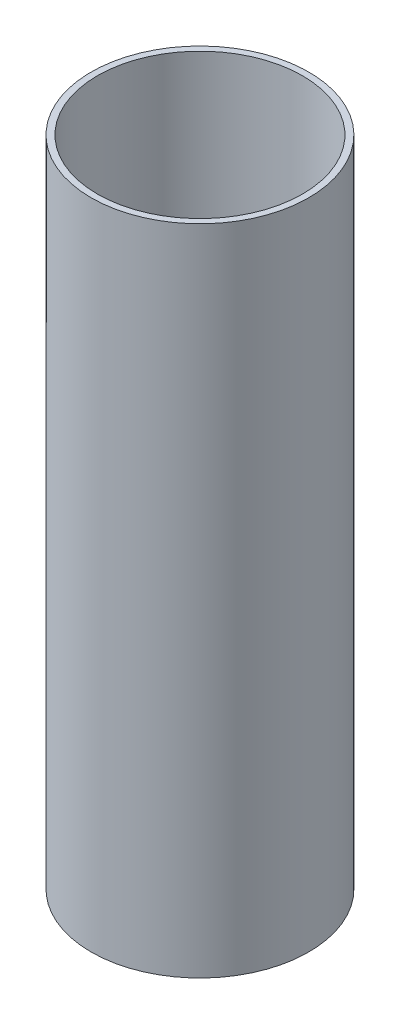
ISO-10303-21;
HEADER;
FILE_DESCRIPTION(('STEP AP214'),'2;1');
FILE_NAME('part.step','',(''),(''),'','','');
FILE_SCHEMA(('AUTOMOTIVE_DESIGN { 1 0 10303 214 1 1 1 1 }'));
ENDSEC;
DATA;
#1=APPLICATION_CONTEXT('core data for automotive mechanical design processes');
#2=APPLICATION_PROTOCOL_DEFINITION('international standard','automotive_design',2000,#1);
#3=PRODUCT_CONTEXT('',#1,'mechanical');
#4=PRODUCT('Part','Part','',(#3));
#5=PRODUCT_RELATED_PRODUCT_CATEGORY('part','',(#4));
#6=PRODUCT_DEFINITION_FORMATION('','',#4);
#7=PRODUCT_DEFINITION_CONTEXT('part definition',#1,'design');
#8=PRODUCT_DEFINITION('design','',#6,#7);
#9=PRODUCT_DEFINITION_SHAPE('','',#8);
#10=(LENGTH_UNIT() NAMED_UNIT(*) SI_UNIT(.MILLI.,.METRE.));
#11=(NAMED_UNIT(*) PLANE_ANGLE_UNIT() SI_UNIT($,.RADIAN.));
#12=(NAMED_UNIT(*) SI_UNIT($,.STERADIAN.) SOLID_ANGLE_UNIT());
#13=UNCERTAINTY_MEASURE_WITH_UNIT(LENGTH_MEASURE(1.E-05),#10,'distance_accuracy_value','');
#14=(GEOMETRIC_REPRESENTATION_CONTEXT(3) GLOBAL_UNCERTAINTY_ASSIGNED_CONTEXT((#13)) GLOBAL_UNIT_ASSIGNED_CONTEXT((#10,
#11,#12)) REPRESENTATION_CONTEXT('',''));
#15=CARTESIAN_POINT('',(0.,0.,0.));
#16=DIRECTION('',(0.,0.,1.));
#17=DIRECTION('',(1.,0.,0.));
#18=AXIS2_PLACEMENT_3D('',#15,#16,#17);
#19=CARTESIAN_POINT('',(0.,0.,0.));
#20=DIRECTION('',(0.,-1.,0.));
#21=DIRECTION('',(0.,0.,-1.));
#22=AXIS2_PLACEMENT_3D('',#19,#20,#21);
#23=CYLINDRICAL_SURFACE('',#22,6.35);
#24=CARTESIAN_POINT('',(0.,-38.1,0.));
#25=DIRECTION('',(0.,1.,0.));
#26=DIRECTION('',(0.,0.,1.));
#27=AXIS2_PLACEMENT_3D('',#24,#25,#26);
#28=CIRCLE('',#27,6.35);
#29=CARTESIAN_POINT('',(0.,-38.1,6.35));
#30=VERTEX_POINT('',#29);
#31=EDGE_CURVE('E44',#30,#30,#28,.T.);
#32=ORIENTED_EDGE('',*,*,#31,.T.);
#33=EDGE_LOOP('',(#32));
#34=FACE_BOUND('',#33,.T.);
#35=CARTESIAN_POINT('',(0.,0.,0.));
#36=DIRECTION('',(0.,1.,0.));
#37=DIRECTION('',(0.,0.,1.));
#38=AXIS2_PLACEMENT_3D('',#35,#36,#37);
#39=CIRCLE('',#38,6.35);
#40=CARTESIAN_POINT('',(0.,0.,6.35));
#41=VERTEX_POINT('',#40);
#42=EDGE_CURVE('E35',#41,#41,#39,.T.);
#43=ORIENTED_EDGE('',*,*,#42,.F.);
#44=EDGE_LOOP('',(#43));
#45=FACE_BOUND('',#44,.T.);
#46=ADVANCED_FACE('F32',(#34,#45),#23,.T.);
#47=CARTESIAN_POINT('',(0.,0.,0.));
#48=DIRECTION('',(0.,1.,0.));
#49=DIRECTION('',(0.,0.,1.));
#50=AXIS2_PLACEMENT_3D('',#47,#48,#49);
#51=PLANE('',#50);
#52=CARTESIAN_POINT('',(0.,0.,0.));
#53=DIRECTION('',(0.,1.,0.));
#54=DIRECTION('',(0.,0.,1.));
#55=AXIS2_PLACEMENT_3D('',#52,#53,#54);
#56=CIRCLE('',#55,5.9807608501618);
#57=CARTESIAN_POINT('',(0.,0.,5.9807608501618));
#58=VERTEX_POINT('',#57);
#59=EDGE_CURVE('E39',#58,#58,#56,.F.);
#60=ORIENTED_EDGE('',*,*,#59,.T.);
#61=EDGE_LOOP('',(#60));
#62=FACE_BOUND('',#61,.T.);
#63=ORIENTED_EDGE('',*,*,#42,.T.);
#64=EDGE_LOOP('',(#63));
#65=FACE_BOUND('',#64,.T.);
#66=ADVANCED_FACE('F52',(#62,#65),#51,.T.);
#67=CARTESIAN_POINT('',(0.,-38.1,0.));
#68=DIRECTION('',(0.,1.,0.));
#69=DIRECTION('',(0.,0.,1.));
#70=AXIS2_PLACEMENT_3D('',#67,#68,#69);
#71=PLANE('',#70);
#72=CARTESIAN_POINT('',(0.,-38.1,0.));
#73=DIRECTION('',(0.,1.,0.));
#74=DIRECTION('',(0.,0.,1.));
#75=AXIS2_PLACEMENT_3D('',#72,#73,#74);
#76=CIRCLE('',#75,5.9807608501618);
#77=CARTESIAN_POINT('',(0.,-38.1,5.9807608501618));
#78=VERTEX_POINT('',#77);
#79=EDGE_CURVE('E10',#78,#78,#76,.F.);
#80=ORIENTED_EDGE('',*,*,#79,.F.);
#81=EDGE_LOOP('',(#80));
#82=FACE_BOUND('',#81,.T.);
#83=ORIENTED_EDGE('',*,*,#31,.F.);
#84=EDGE_LOOP('',(#83));
#85=FACE_BOUND('',#84,.T.);
#86=ADVANCED_FACE('F58',(#82,#85),#71,.F.);
#87=CARTESIAN_POINT('',(0.,0.,0.));
#88=DIRECTION('',(0.,-1.,0.));
#89=DIRECTION('',(0.,0.,-1.));
#90=AXIS2_PLACEMENT_3D('',#87,#88,#89);
#91=CYLINDRICAL_SURFACE('',#90,5.9807608501618);
#92=ORIENTED_EDGE('',*,*,#79,.T.);
#93=EDGE_LOOP('',(#92));
#94=FACE_BOUND('',#93,.T.);
#95=ORIENTED_EDGE('',*,*,#59,.F.);
#96=EDGE_LOOP('',(#95));
#97=FACE_BOUND('',#96,.T.);
#98=ADVANCED_FACE('F60',(#94,#97),#91,.F.);
#99=CLOSED_SHELL('',(#46,#66,#86,#98));
#100=MANIFOLD_SOLID_BREP('B2',#99);
#101=ADVANCED_BREP_SHAPE_REPRESENTATION('',(#18,#100),#14);
#102=SHAPE_DEFINITION_REPRESENTATION(#9,#101);
ENDSEC;
END-ISO-10303-21;
